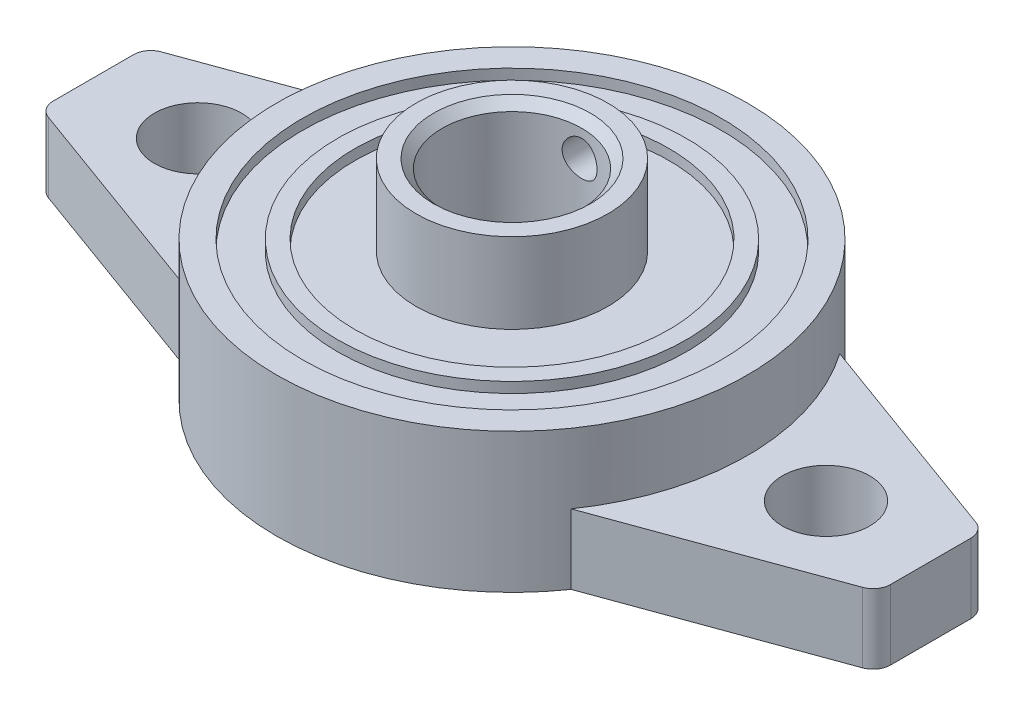
ISO-10303-21;
HEADER;
FILE_DESCRIPTION(('STEP AP214'),'2;1');
FILE_NAME('part.step','',(''),(''),'','','');
FILE_SCHEMA(('AUTOMOTIVE_DESIGN { 1 0 10303 214 1 1 1 1 }'));
ENDSEC;
DATA;
#1=APPLICATION_CONTEXT('core data for automotive mechanical design processes');
#2=APPLICATION_PROTOCOL_DEFINITION('international standard','automotive_design',2000,#1);
#3=PRODUCT_CONTEXT('',#1,'mechanical');
#4=PRODUCT('Part','Part','',(#3));
#5=PRODUCT_RELATED_PRODUCT_CATEGORY('part','',(#4));
#6=PRODUCT_DEFINITION_FORMATION('','',#4);
#7=PRODUCT_DEFINITION_CONTEXT('part definition',#1,'design');
#8=PRODUCT_DEFINITION('design','',#6,#7);
#9=PRODUCT_DEFINITION_SHAPE('','',#8);
#10=(LENGTH_UNIT() NAMED_UNIT(*) SI_UNIT(.MILLI.,.METRE.));
#11=(NAMED_UNIT(*) PLANE_ANGLE_UNIT() SI_UNIT($,.RADIAN.));
#12=(NAMED_UNIT(*) SI_UNIT($,.STERADIAN.) SOLID_ANGLE_UNIT());
#13=UNCERTAINTY_MEASURE_WITH_UNIT(LENGTH_MEASURE(1.E-05),#10,'distance_accuracy_value','');
#14=(GEOMETRIC_REPRESENTATION_CONTEXT(3) GLOBAL_UNCERTAINTY_ASSIGNED_CONTEXT((#13)) GLOBAL_UNIT_ASSIGNED_CONTEXT((#10,
#11,#12)) REPRESENTATION_CONTEXT('',''));
#15=CARTESIAN_POINT('',(0.,0.,0.));
#16=DIRECTION('',(0.,0.,1.));
#17=DIRECTION('',(1.,0.,0.));
#18=AXIS2_PLACEMENT_3D('',#15,#16,#17);
#19=CARTESIAN_POINT('',(0.,-2.50000000007189E-05,0.));
#20=DIRECTION('',(0.,1.,0.));
#21=DIRECTION('',(0.,0.,1.));
#22=AXIS2_PLACEMENT_3D('',#19,#20,#21);
#23=CYLINDRICAL_SURFACE('',#22,4.);
#24=CARTESIAN_POINT('',(0.,1.5,0.));
#25=DIRECTION('',(0.,-1.,0.));
#26=DIRECTION('',(0.,0.,-1.));
#27=AXIS2_PLACEMENT_3D('',#24,#25,#26);
#28=CIRCLE('',#27,4.);
#29=CARTESIAN_POINT('',(0.,1.5,-4.));
#30=VERTEX_POINT('',#29);
#31=EDGE_CURVE('E49',#30,#30,#28,.T.);
#32=ORIENTED_EDGE('',*,*,#31,.T.);
#33=EDGE_LOOP('',(#32));
#34=FACE_BOUND('',#33,.T.);
#35=CARTESIAN_POINT('',(0.,11.5,0.));
#36=DIRECTION('',(0.,1.,0.));
#37=DIRECTION('',(0.,0.,1.));
#38=AXIS2_PLACEMENT_3D('',#35,#36,#37);
#39=CIRCLE('',#38,4.);
#40=CARTESIAN_POINT('',(0.,11.5,4.));
#41=VERTEX_POINT('',#40);
#42=EDGE_CURVE('E307',#41,#41,#39,.T.);
#43=ORIENTED_EDGE('',*,*,#42,.T.);
#44=EDGE_LOOP('',(#43));
#45=FACE_BOUND('',#44,.T.);
#46=CARTESIAN_POINT('',(1.,10.,-3.87298334620742));
#47=CARTESIAN_POINT('',(0.9999984314387,9.94477969964321,-3.87298440057185));
#48=CARTESIAN_POINT('',(0.99541049820807,9.88954204056864,-3.87417722499278));
#49=CARTESIAN_POINT('',(0.977209250194446,9.78065296876739,-3.87880744892249));
#50=CARTESIAN_POINT('',(0.963590682698077,9.72700249822003,-3.8822461547418));
#51=CARTESIAN_POINT('',(0.927796479849635,9.62287858471216,-3.89095489813012));
#52=CARTESIAN_POINT('',(0.905631891140944,9.57240113784224,-3.8962225706936));
#53=CARTESIAN_POINT('',(0.853408456505407,9.47587565898752,-3.90799276818327));
#54=CARTESIAN_POINT('',(0.823349275424505,9.42982781516885,-3.91449534553241));
#55=CARTESIAN_POINT('',(0.755483370924517,9.34245534189415,-3.92816286540368));
#56=CARTESIAN_POINT('',(0.717534755081557,9.30124255985972,-3.93533839048709));
#57=CARTESIAN_POINT('',(0.635272825640328,9.22569544225612,-3.94945150206622));
#58=CARTESIAN_POINT('',(0.590958917672139,9.19136174975137,-3.95638906626691));
#59=CARTESIAN_POINT('',(0.496458080431564,9.13008981294742,-3.96936166208095));
#60=CARTESIAN_POINT('',(0.446197830478043,9.10326144473539,-3.975382749602));
#61=CARTESIAN_POINT('',(0.341705273717109,9.05847614233878,-3.9857232477043));
#62=CARTESIAN_POINT('',(0.287473554316777,9.0405178992338,-3.99004290933747));
#63=CARTESIAN_POINT('',(0.177743503501663,9.01434086616856,-3.99641903539262));
#64=CARTESIAN_POINT('',(0.122293087819589,9.00593214226937,-3.99851957537723));
#65=CARTESIAN_POINT('',(0.0107315277051075,8.99849664828978,-4.00037437642922));
#66=CARTESIAN_POINT('',(-0.0453795178152279,8.99946849111616,-4.00012898438682));
#67=CARTESIAN_POINT('',(-0.155352247172388,9.01062994010006,-3.99735237981413));
#68=CARTESIAN_POINT('',(-0.209236215601068,9.02061453002154,-3.99487200936349));
#69=CARTESIAN_POINT('',(-0.314538247413687,9.0491885080194,-3.98796334609942));
#70=CARTESIAN_POINT('',(-0.365956179370439,9.06777835415096,-3.98353494959376));
#71=CARTESIAN_POINT('',(-0.465406703501807,9.11320102827483,-3.97315003880358));
#72=CARTESIAN_POINT('',(-0.513404509766505,9.1401068178647,-3.96718007878021));
#73=CARTESIAN_POINT('',(-0.604275622340489,9.2013422716465,-3.9543596152386));
#74=CARTESIAN_POINT('',(-0.647148035085506,9.23567322742425,-3.94750895860996));
#75=CARTESIAN_POINT('',(-0.727774035084957,9.31188349679295,-3.93345485507808));
#76=CARTESIAN_POINT('',(-0.7653576790752,9.35394195693911,-3.92624687810367));
#77=CARTESIAN_POINT('',(-0.832976375963019,9.4438399894161,-3.91246017406683));
#78=CARTESIAN_POINT('',(-0.863011076046017,9.4916798317964,-3.90588147642388));
#79=CARTESIAN_POINT('',(-0.914788129022598,9.59211601365959,-3.89408198732659));
#80=CARTESIAN_POINT('',(-0.936489566970491,9.64473429212528,-3.88886793490288));
#81=CARTESIAN_POINT('',(-0.970685620636341,9.75303418723058,-3.88047456055983));
#82=CARTESIAN_POINT('',(-0.98318220655291,9.80871514559325,-3.87729480324087));
#83=CARTESIAN_POINT('',(-0.998331855466071,9.91998380060925,-3.87342142415656));
#84=CARTESIAN_POINT('',(-1.00123618956785,9.97553511733185,-3.87266435637459));
#85=CARTESIAN_POINT('',(-0.997806796206219,10.0863287746313,-3.87354937392416));
#86=CARTESIAN_POINT('',(-0.99147391913952,10.1415711431805,-3.87519123840506));
#87=CARTESIAN_POINT('',(-0.969970185575065,10.2492457059819,-3.88062832781824));
#88=CARTESIAN_POINT('',(-0.954945627312698,10.3017090906283,-3.8843878809375));
#89=CARTESIAN_POINT('',(-0.916647232668248,10.4033725831407,-3.89360287308385));
#90=CARTESIAN_POINT('',(-0.893372419085018,10.4525723036221,-3.89905851299445));
#91=CARTESIAN_POINT('',(-0.838708267174622,10.5473765111469,-3.91118454837305));
#92=CARTESIAN_POINT('',(-0.807168701534251,10.5928915360172,-3.91787667442657));
#93=CARTESIAN_POINT('',(-0.737060292934455,10.6780753451205,-3.93166833228686));
#94=CARTESIAN_POINT('',(-0.698490294805438,10.71774316666,-3.93876793091388));
#95=CARTESIAN_POINT('',(-0.614262720984724,10.7911244170284,-3.95278961212643));
#96=CARTESIAN_POINT('',(-0.568451952531591,10.8246640250195,-3.95970280824734));
#97=CARTESIAN_POINT('',(-0.471702682694674,10.8835743467805,-3.97238886645494));
#98=CARTESIAN_POINT('',(-0.42076444895759,10.9089454866433,-3.97816178801584));
#99=CARTESIAN_POINT('',(-0.315558201731089,10.9505784138112,-3.98788046295326));
#100=CARTESIAN_POINT('',(-0.26131738102788,10.9669057137516,-3.99183932008964));
#101=CARTESIAN_POINT('',(-0.150749760318806,10.9901841338434,-3.99754117358315));
#102=CARTESIAN_POINT('',(-0.0944233650412424,10.9971370634956,-3.99928459757363));
#103=CARTESIAN_POINT('',(0.0170835264433275,11.0013675895755,-4.00034169408811));
#104=CARTESIAN_POINT('',(0.0722538269660343,10.9989017090954,-3.99971978880008));
#105=CARTESIAN_POINT('',(0.181367496414741,10.9849521727057,-3.99625896457423));
#106=CARTESIAN_POINT('',(0.235310901780888,10.9734687849869,-3.99342011157094));
#107=CARTESIAN_POINT('',(0.340171035644817,10.9419477802291,-3.98585432853963));
#108=CARTESIAN_POINT('',(0.391102494581019,10.9219565466854,-3.98113764502668));
#109=CARTESIAN_POINT('',(0.488917053041468,10.8740294209807,-3.97031288913382));
#110=CARTESIAN_POINT('',(0.535799641265051,10.8460925273304,-3.96420464137727));
#111=CARTESIAN_POINT('',(0.625401928423901,10.7822847660029,-3.95107249681342));
#112=CARTESIAN_POINT('',(0.667994988300588,10.7462398570926,-3.94403016945647));
#113=CARTESIAN_POINT('',(0.746615020271252,10.6675771480262,-3.92990649053207));
#114=CARTESIAN_POINT('',(0.782640325068178,10.6249576839021,-3.92282512952424));
#115=CARTESIAN_POINT('',(0.84776202647924,10.5333985857987,-3.90927475860683));
#116=CARTESIAN_POINT('',(0.876716619446593,10.4843558765875,-3.90281963730391));
#117=CARTESIAN_POINT('',(0.925926896615622,10.3819445100772,-3.8914395555011));
#118=CARTESIAN_POINT('',(0.946188909759557,10.3285790338927,-3.88651348244814));
#119=CARTESIAN_POINT('',(0.974422528565572,10.2294229881737,-3.87951908741315));
#120=CARTESIAN_POINT('',(0.983993170595829,10.1841068356176,-3.87708663005761));
#121=CARTESIAN_POINT('',(0.99678229257282,10.0925311309985,-3.87381838580358));
#122=CARTESIAN_POINT('',(1.00000131437052,10.0462716597494,-3.87298246270639));
#123=CARTESIAN_POINT('',(1.,10.,-3.87298334620742));
#124=B_SPLINE_CURVE_WITH_KNOTS('',3,(#46,#47,#48,#49,#50,#51,#52,#53,#54,#55,#56,#57,#58,#59,
#60,#61,#62,#63,#64,#65,#66,#67,#68,#69,#70,#71,#72,#73,#74,#75,#76,#77,#78,#79,#80,#81,#82,#83,
#84,#85,#86,#87,#88,#89,#90,#91,#92,#93,#94,#95,#96,#97,#98,#99,#100,#101,#102,#103,#104,#105,
#106,#107,#108,#109,#110,#111,#112,#113,#114,#115,#116,#117,#118,#119,#120,#121,#122,#123),
.UNSPECIFIED.,.T.,.F.,(4,2,2,2,2,2,2,2,2,2,2,2,2,2,2,2,2,2,2,2,2,2,2,2,2,2,2,2,2,2,2,2,2,2,2,2,
2,2,4),(0.,0.16549097667523,0.331078296534212,0.496452290829153,0.661833306984659,
0.830495816734649,0.999174085882212,1.17020598555443,1.34121263935111,1.50875500394413,
1.67627259462683,1.84007305071853,2.00388222686189,2.16917149698052,2.3344895418384,
2.50428186625039,2.67408212476195,2.84470572799635,3.01529280048094,3.18137429900962,
3.34744050869795,3.51078961999957,3.67415808564842,3.84073138339938,4.00733207550293,
4.17810132382402,4.34886166284096,4.51836829119046,4.6878421955989,4.85273378447257,
5.01762046947067,5.18161950620159,5.34563922291504,5.51358838629103,5.68158012622478,
5.85270590910145,6.02370688542923,6.16239130867207,6.30106390036083),.UNSPECIFIED.);
#125=CARTESIAN_POINT('',(1.,10.,-3.87298334620742));
#126=VERTEX_POINT('',#125);
#127=EDGE_CURVE('E207',#126,#126,#124,.T.);
#128=ORIENTED_EDGE('',*,*,#127,.T.);
#129=EDGE_LOOP('',(#128));
#130=FACE_BOUND('',#129,.T.);
#131=ADVANCED_FACE('F40',(#34,#45,#130),#23,.F.);
#132=CARTESIAN_POINT('',(0.,8.,0.));
#133=DIRECTION('',(0.,1.,0.));
#134=DIRECTION('',(0.,0.,1.));
#135=AXIS2_PLACEMENT_3D('',#132,#133,#134);
#136=PLANE('',#135);
#137=CARTESIAN_POINT('',(0.,8.,0.));
#138=DIRECTION('',(0.,1.,0.));
#139=DIRECTION('',(0.,0.,1.));
#140=AXIS2_PLACEMENT_3D('',#137,#138,#139);
#141=CIRCLE('',#140,9.);
#142=CARTESIAN_POINT('',(0.,8.,9.));
#143=VERTEX_POINT('',#142);
#144=EDGE_CURVE('E396',#143,#143,#141,.T.);
#145=ORIENTED_EDGE('',*,*,#144,.F.);
#146=EDGE_LOOP('',(#145));
#147=FACE_BOUND('',#146,.T.);
#148=CARTESIAN_POINT('',(0.,8.,0.));
#149=DIRECTION('',(0.,1.,0.));
#150=DIRECTION('',(0.,0.,1.));
#151=AXIS2_PLACEMENT_3D('',#148,#149,#150);
#152=CIRCLE('',#151,10.);
#153=CARTESIAN_POINT('',(0.,8.,10.));
#154=VERTEX_POINT('',#153);
#155=EDGE_CURVE('E385',#154,#154,#152,.T.);
#156=ORIENTED_EDGE('',*,*,#155,.T.);
#157=EDGE_LOOP('',(#156));
#158=FACE_BOUND('',#157,.T.);
#159=ADVANCED_FACE('F236',(#147,#158),#136,.T.);
#160=CARTESIAN_POINT('',(0.,8.,0.));
#161=DIRECTION('',(0.,1.,0.));
#162=DIRECTION('',(0.,0.,1.));
#163=AXIS2_PLACEMENT_3D('',#160,#161,#162);
#164=CIRCLE('',#163,12.);
#165=CARTESIAN_POINT('',(0.,8.,12.));
#166=VERTEX_POINT('',#165);
#167=EDGE_CURVE('E268',#166,#166,#164,.T.);
#168=ORIENTED_EDGE('',*,*,#167,.F.);
#169=EDGE_LOOP('',(#168));
#170=FACE_BOUND('',#169,.T.);
#171=CARTESIAN_POINT('',(0.,8.,0.));
#172=DIRECTION('',(0.,1.,0.));
#173=DIRECTION('',(0.,0.,1.));
#174=AXIS2_PLACEMENT_3D('',#171,#172,#173);
#175=CIRCLE('',#174,13.5);
#176=CARTESIAN_POINT('',(0.,8.,13.5));
#177=VERTEX_POINT('',#176);
#178=EDGE_CURVE('E261',#177,#177,#175,.T.);
#179=ORIENTED_EDGE('',*,*,#178,.T.);
#180=EDGE_LOOP('',(#179));
#181=FACE_BOUND('',#180,.T.);
#182=ADVANCED_FACE('F371',(#170,#181),#136,.T.);
#183=CARTESIAN_POINT('',(23.,4.,2.29979246179029));
#184=DIRECTION('',(0.,1.,0.));
#185=DIRECTION('',(0.,0.,1.));
#186=AXIS2_PLACEMENT_3D('',#183,#184,#185);
#187=PLANE('',#186);
#188=CARTESIAN_POINT('',(0.,4.,0.));
#189=DIRECTION('',(0.,1.,0.));
#190=DIRECTION('',(0.,0.,1.));
#191=AXIS2_PLACEMENT_3D('',#188,#189,#190);
#192=CIRCLE('',#191,13.5);
#193=CARTESIAN_POINT('',(11.0893677538251,4.,7.69908584316501));
#194=VERTEX_POINT('',#193);
#195=CARTESIAN_POINT('',(11.0893677538251,4.,-7.69908584316501));
#196=VERTEX_POINT('',#195);
#197=EDGE_CURVE('E257',#194,#196,#192,.T.);
#198=ORIENTED_EDGE('',*,*,#197,.F.);
#199=DIRECTION('',(0.93969262078591,0.,-0.342020143325665));
#200=VECTOR('',#199,1.);
#201=CARTESIAN_POINT('',(23.3420201433257,4.,3.2394850825762));
#202=LINE('',#201,#200);
#203=CARTESIAN_POINT('',(23.3420201433257,4.,3.2394850825762));
#204=VERTEX_POINT('',#203);
#205=EDGE_CURVE('E57',#194,#204,#202,.T.);
#206=ORIENTED_EDGE('',*,*,#205,.T.);
#207=CARTESIAN_POINT('',(23.,4.,2.29979246179029));
#208=DIRECTION('',(0.,1.,0.));
#209=DIRECTION('',(0.,0.,1.));
#210=AXIS2_PLACEMENT_3D('',#207,#208,#209);
#211=CIRCLE('',#210,1.);
#212=CARTESIAN_POINT('',(24.,4.,2.29979246179028));
#213=VERTEX_POINT('',#212);
#214=EDGE_CURVE('E638',#204,#213,#211,.T.);
#215=ORIENTED_EDGE('',*,*,#214,.T.);
#216=DIRECTION('',(0.,0.,-1.));
#217=VECTOR('',#216,1.);
#218=CARTESIAN_POINT('',(24.,4.,2.29979246179028));
#219=LINE('',#218,#217);
#220=CARTESIAN_POINT('',(24.,4.,-2.29979246179028));
#221=VERTEX_POINT('',#220);
#222=EDGE_CURVE('E115',#213,#221,#219,.T.);
#223=ORIENTED_EDGE('',*,*,#222,.T.);
#224=CARTESIAN_POINT('',(23.,4.,-2.29979246179029));
#225=DIRECTION('',(0.,1.,0.));
#226=DIRECTION('',(0.,0.,1.));
#227=AXIS2_PLACEMENT_3D('',#224,#225,#226);
#228=CIRCLE('',#227,1.);
#229=CARTESIAN_POINT('',(23.3420201433257,4.,-3.2394850825762));
#230=VERTEX_POINT('',#229);
#231=EDGE_CURVE('E192',#221,#230,#228,.T.);
#232=ORIENTED_EDGE('',*,*,#231,.T.);
#233=DIRECTION('',(-0.93969262078591,0.,-0.342020143325665));
#234=VECTOR('',#233,1.);
#235=CARTESIAN_POINT('',(23.3420201433257,4.,-3.2394850825762));
#236=LINE('',#235,#234);
#237=EDGE_CURVE('E188',#230,#196,#236,.T.);
#238=ORIENTED_EDGE('',*,*,#237,.T.);
#239=EDGE_LOOP('',(#198,#206,#215,#223,#232,#238));
#240=FACE_BOUND('',#239,.T.);
#241=CARTESIAN_POINT('',(18.,4.,0.));
#242=DIRECTION('',(0.,1.,0.));
#243=DIRECTION('',(0.,0.,1.));
#244=AXIS2_PLACEMENT_3D('',#241,#242,#243);
#245=CIRCLE('',#244,2.5);
#246=CARTESIAN_POINT('',(18.,4.,2.5));
#247=VERTEX_POINT('',#246);
#248=EDGE_CURVE('E273',#247,#247,#245,.T.);
#249=ORIENTED_EDGE('',*,*,#248,.F.);
#250=EDGE_LOOP('',(#249));
#251=FACE_BOUND('',#250,.T.);
#252=ADVANCED_FACE('F365',(#240,#251),#187,.T.);
#253=CARTESIAN_POINT('',(-11.0893677538251,4.,-7.69908584316501));
#254=VERTEX_POINT('',#253);
#255=CARTESIAN_POINT('',(-11.0893677538251,4.,7.69908584316501));
#256=VERTEX_POINT('',#255);
#257=EDGE_CURVE('E169',#254,#256,#192,.T.);
#258=ORIENTED_EDGE('',*,*,#257,.F.);
#259=DIRECTION('',(-0.93969262078591,0.,0.342020143325665));
#260=VECTOR('',#259,1.);
#261=CARTESIAN_POINT('',(-23.3420201433257,4.,-3.2394850825762));
#262=LINE('',#261,#260);
#263=CARTESIAN_POINT('',(-23.3420201433257,4.,-3.2394850825762));
#264=VERTEX_POINT('',#263);
#265=EDGE_CURVE('E185',#254,#264,#262,.T.);
#266=ORIENTED_EDGE('',*,*,#265,.T.);
#267=CARTESIAN_POINT('',(-23.,4.,-2.29979246179029));
#268=DIRECTION('',(0.,1.,0.));
#269=DIRECTION('',(0.,0.,1.));
#270=AXIS2_PLACEMENT_3D('',#267,#268,#269);
#271=CIRCLE('',#270,1.);
#272=CARTESIAN_POINT('',(-24.,4.,-2.29979246179028));
#273=VERTEX_POINT('',#272);
#274=EDGE_CURVE('E187',#264,#273,#271,.T.);
#275=ORIENTED_EDGE('',*,*,#274,.T.);
#276=DIRECTION('',(0.,0.,1.));
#277=VECTOR('',#276,1.);
#278=CARTESIAN_POINT('',(-24.,4.,2.29979246179028));
#279=LINE('',#278,#277);
#280=CARTESIAN_POINT('',(-24.,4.,2.29979246179028));
#281=VERTEX_POINT('',#280);
#282=EDGE_CURVE('E147',#273,#281,#279,.T.);
#283=ORIENTED_EDGE('',*,*,#282,.T.);
#284=CARTESIAN_POINT('',(-23.,4.,2.29979246179029));
#285=DIRECTION('',(0.,1.,0.));
#286=DIRECTION('',(0.,0.,1.));
#287=AXIS2_PLACEMENT_3D('',#284,#285,#286);
#288=CIRCLE('',#287,1.);
#289=CARTESIAN_POINT('',(-23.3420201433257,4.,3.2394850825762));
#290=VERTEX_POINT('',#289);
#291=EDGE_CURVE('E139',#281,#290,#288,.T.);
#292=ORIENTED_EDGE('',*,*,#291,.T.);
#293=DIRECTION('',(0.93969262078591,0.,0.342020143325665));
#294=VECTOR('',#293,1.);
#295=CARTESIAN_POINT('',(-23.3420201433257,4.,3.2394850825762));
#296=LINE('',#295,#294);
#297=EDGE_CURVE('E144',#290,#256,#296,.T.);
#298=ORIENTED_EDGE('',*,*,#297,.T.);
#299=EDGE_LOOP('',(#258,#266,#275,#283,#292,#298));
#300=FACE_BOUND('',#299,.T.);
#301=CARTESIAN_POINT('',(-18.,4.,0.));
#302=DIRECTION('',(0.,1.,0.));
#303=DIRECTION('',(0.,0.,1.));
#304=AXIS2_PLACEMENT_3D('',#301,#302,#303);
#305=CIRCLE('',#304,2.5);
#306=CARTESIAN_POINT('',(-18.,4.,2.5));
#307=VERTEX_POINT('',#306);
#308=EDGE_CURVE('E634',#307,#307,#305,.T.);
#309=ORIENTED_EDGE('',*,*,#308,.F.);
#310=EDGE_LOOP('',(#309));
#311=FACE_BOUND('',#310,.T.);
#312=ADVANCED_FACE('F141',(#300,#311),#187,.T.);
#313=CARTESIAN_POINT('',(23.,0.,2.29979246179029));
#314=DIRECTION('',(0.,1.,0.));
#315=DIRECTION('',(0.,0.,1.));
#316=AXIS2_PLACEMENT_3D('',#313,#314,#315);
#317=PLANE('',#316);
#318=CARTESIAN_POINT('',(0.,0.,0.));
#319=DIRECTION('',(0.,-1.,0.));
#320=DIRECTION('',(0.,0.,-1.));
#321=AXIS2_PLACEMENT_3D('',#318,#319,#320);
#322=CIRCLE('',#321,12.5);
#323=CARTESIAN_POINT('',(0.,0.,-12.5));
#324=VERTEX_POINT('',#323);
#325=EDGE_CURVE('E230',#324,#324,#322,.T.);
#326=ORIENTED_EDGE('',*,*,#325,.F.);
#327=EDGE_LOOP('',(#326));
#328=FACE_BOUND('',#327,.T.);
#329=CARTESIAN_POINT('',(-18.,0.,0.));
#330=DIRECTION('',(0.,1.,0.));
#331=DIRECTION('',(0.,0.,1.));
#332=AXIS2_PLACEMENT_3D('',#329,#330,#331);
#333=CIRCLE('',#332,2.5);
#334=CARTESIAN_POINT('',(-18.,0.,2.5));
#335=VERTEX_POINT('',#334);
#336=EDGE_CURVE('E626',#335,#335,#333,.T.);
#337=ORIENTED_EDGE('',*,*,#336,.T.);
#338=EDGE_LOOP('',(#337));
#339=FACE_BOUND('',#338,.T.);
#340=CARTESIAN_POINT('',(23.,0.,2.29979246179029));
#341=DIRECTION('',(0.,1.,0.));
#342=DIRECTION('',(0.,0.,1.));
#343=AXIS2_PLACEMENT_3D('',#340,#341,#342);
#344=CIRCLE('',#343,1.);
#345=CARTESIAN_POINT('',(23.3420201433257,0.,3.2394850825762));
#346=VERTEX_POINT('',#345);
#347=CARTESIAN_POINT('',(24.,0.,2.29979246179028));
#348=VERTEX_POINT('',#347);
#349=EDGE_CURVE('E628',#346,#348,#344,.T.);
#350=ORIENTED_EDGE('',*,*,#349,.F.);
#351=DIRECTION('',(0.93969262078591,0.,-0.342020143325665));
#352=VECTOR('',#351,1.);
#353=CARTESIAN_POINT('',(23.3420201433257,0.,3.2394850825762));
#354=LINE('',#353,#352);
#355=CARTESIAN_POINT('',(11.0893677538251,0.,7.69908584316501));
#356=VERTEX_POINT('',#355);
#357=EDGE_CURVE('E106',#356,#346,#354,.T.);
#358=ORIENTED_EDGE('',*,*,#357,.F.);
#359=CARTESIAN_POINT('',(0.,0.,0.));
#360=DIRECTION('',(0.,1.,0.));
#361=DIRECTION('',(0.,0.,1.));
#362=AXIS2_PLACEMENT_3D('',#359,#360,#361);
#363=CIRCLE('',#362,13.5);
#364=CARTESIAN_POINT('',(-11.0893677538251,0.,7.69908584316501));
#365=VERTEX_POINT('',#364);
#366=EDGE_CURVE('E100',#365,#356,#363,.T.);
#367=ORIENTED_EDGE('',*,*,#366,.F.);
#368=DIRECTION('',(0.93969262078591,0.,0.342020143325665));
#369=VECTOR('',#368,1.);
#370=CARTESIAN_POINT('',(-23.3420201433257,0.,3.2394850825762));
#371=LINE('',#370,#369);
#372=CARTESIAN_POINT('',(-23.3420201433257,0.,3.2394850825762));
#373=VERTEX_POINT('',#372);
#374=EDGE_CURVE('E660',#373,#365,#371,.T.);
#375=ORIENTED_EDGE('',*,*,#374,.F.);
#376=CARTESIAN_POINT('',(-23.,0.,2.29979246179029));
#377=DIRECTION('',(0.,1.,0.));
#378=DIRECTION('',(0.,0.,1.));
#379=AXIS2_PLACEMENT_3D('',#376,#377,#378);
#380=CIRCLE('',#379,1.);
#381=CARTESIAN_POINT('',(-24.,0.,2.29979246179028));
#382=VERTEX_POINT('',#381);
#383=EDGE_CURVE('E156',#382,#373,#380,.T.);
#384=ORIENTED_EDGE('',*,*,#383,.F.);
#385=DIRECTION('',(0.,0.,1.));
#386=VECTOR('',#385,1.);
#387=CARTESIAN_POINT('',(-24.,0.,2.29979246179028));
#388=LINE('',#387,#386);
#389=CARTESIAN_POINT('',(-24.,0.,-2.29979246179028));
#390=VERTEX_POINT('',#389);
#391=EDGE_CURVE('E657',#390,#382,#388,.T.);
#392=ORIENTED_EDGE('',*,*,#391,.F.);
#393=CARTESIAN_POINT('',(-23.,0.,-2.29979246179029));
#394=DIRECTION('',(0.,1.,0.));
#395=DIRECTION('',(0.,0.,1.));
#396=AXIS2_PLACEMENT_3D('',#393,#394,#395);
#397=CIRCLE('',#396,1.);
#398=CARTESIAN_POINT('',(-23.3420201433257,0.,-3.2394850825762));
#399=VERTEX_POINT('',#398);
#400=EDGE_CURVE('E655',#399,#390,#397,.T.);
#401=ORIENTED_EDGE('',*,*,#400,.F.);
#402=DIRECTION('',(-0.93969262078591,0.,0.342020143325665));
#403=VECTOR('',#402,1.);
#404=CARTESIAN_POINT('',(-23.3420201433257,0.,-3.2394850825762));
#405=LINE('',#404,#403);
#406=CARTESIAN_POINT('',(-11.0893677538251,0.,-7.69908584316501));
#407=VERTEX_POINT('',#406);
#408=EDGE_CURVE('E653',#407,#399,#405,.T.);
#409=ORIENTED_EDGE('',*,*,#408,.F.);
#410=CARTESIAN_POINT('',(0.,0.,0.));
#411=DIRECTION('',(0.,1.,0.));
#412=DIRECTION('',(0.,0.,1.));
#413=AXIS2_PLACEMENT_3D('',#410,#411,#412);
#414=CIRCLE('',#413,13.5);
#415=CARTESIAN_POINT('',(11.0893677538251,0.,-7.69908584316501));
#416=VERTEX_POINT('',#415);
#417=EDGE_CURVE('E651',#416,#407,#414,.T.);
#418=ORIENTED_EDGE('',*,*,#417,.F.);
#419=DIRECTION('',(-0.93969262078591,0.,-0.342020143325665));
#420=VECTOR('',#419,1.);
#421=CARTESIAN_POINT('',(23.3420201433257,0.,-3.2394850825762));
#422=LINE('',#421,#420);
#423=CARTESIAN_POINT('',(23.3420201433257,0.,-3.2394850825762));
#424=VERTEX_POINT('',#423);
#425=EDGE_CURVE('E649',#424,#416,#422,.T.);
#426=ORIENTED_EDGE('',*,*,#425,.F.);
#427=CARTESIAN_POINT('',(23.,0.,-2.29979246179029));
#428=DIRECTION('',(0.,1.,0.));
#429=DIRECTION('',(0.,0.,1.));
#430=AXIS2_PLACEMENT_3D('',#427,#428,#429);
#431=CIRCLE('',#430,1.);
#432=CARTESIAN_POINT('',(24.,0.,-2.29979246179028));
#433=VERTEX_POINT('',#432);
#434=EDGE_CURVE('E647',#433,#424,#431,.T.);
#435=ORIENTED_EDGE('',*,*,#434,.F.);
#436=DIRECTION('',(0.,0.,-1.));
#437=VECTOR('',#436,1.);
#438=CARTESIAN_POINT('',(24.,0.,2.29979246179028));
#439=LINE('',#438,#437);
#440=EDGE_CURVE('E645',#348,#433,#439,.T.);
#441=ORIENTED_EDGE('',*,*,#440,.F.);
#442=EDGE_LOOP('',(#350,#358,#367,#375,#384,#392,#401,#409,#418,#426,#435,#441));
#443=FACE_BOUND('',#442,.T.);
#444=CARTESIAN_POINT('',(18.,0.,0.));
#445=DIRECTION('',(0.,1.,0.));
#446=DIRECTION('',(0.,0.,1.));
#447=AXIS2_PLACEMENT_3D('',#444,#445,#446);
#448=CIRCLE('',#447,2.5);
#449=CARTESIAN_POINT('',(18.,0.,2.5));
#450=VERTEX_POINT('',#449);
#451=EDGE_CURVE('E271',#450,#450,#448,.T.);
#452=ORIENTED_EDGE('',*,*,#451,.T.);
#453=EDGE_LOOP('',(#452));
#454=FACE_BOUND('',#453,.T.);
#455=ADVANCED_FACE('F327',(#328,#339,#443,#454),#317,.F.);
#456=CARTESIAN_POINT('',(23.,4.,2.29979246179029));
#457=DIRECTION('',(0.,-1.,0.));
#458=DIRECTION('',(0.,0.,-1.));
#459=AXIS2_PLACEMENT_3D('',#456,#457,#458);
#460=CYLINDRICAL_SURFACE('',#459,1.);
#461=ORIENTED_EDGE('',*,*,#349,.T.);
#462=DIRECTION('',(0.,-1.,0.));
#463=VECTOR('',#462,1.);
#464=CARTESIAN_POINT('',(24.,4.,2.29979246179028));
#465=LINE('',#464,#463);
#466=EDGE_CURVE('E277',#213,#348,#465,.T.);
#467=ORIENTED_EDGE('',*,*,#466,.F.);
#468=ORIENTED_EDGE('',*,*,#214,.F.);
#469=DIRECTION('',(0.,-1.,0.));
#470=VECTOR('',#469,1.);
#471=CARTESIAN_POINT('',(23.3420201433257,4.,3.2394850825762));
#472=LINE('',#471,#470);
#473=EDGE_CURVE('E165',#204,#346,#472,.T.);
#474=ORIENTED_EDGE('',*,*,#473,.T.);
#475=EDGE_LOOP('',(#461,#467,#468,#474));
#476=FACE_BOUND('',#475,.T.);
#477=ADVANCED_FACE('F323',(#476),#460,.T.);
#478=CARTESIAN_POINT('',(24.,4.,2.29979246179028));
#479=DIRECTION('',(-1.,0.,0.));
#480=DIRECTION('',(0.,0.,1.));
#481=AXIS2_PLACEMENT_3D('',#478,#479,#480);
#482=PLANE('',#481);
#483=ORIENTED_EDGE('',*,*,#440,.T.);
#484=DIRECTION('',(0.,-1.,0.));
#485=VECTOR('',#484,1.);
#486=CARTESIAN_POINT('',(24.,4.,-2.29979246179028));
#487=LINE('',#486,#485);
#488=EDGE_CURVE('E299',#221,#433,#487,.T.);
#489=ORIENTED_EDGE('',*,*,#488,.F.);
#490=ORIENTED_EDGE('',*,*,#222,.F.);
#491=ORIENTED_EDGE('',*,*,#466,.T.);
#492=EDGE_LOOP('',(#483,#489,#490,#491));
#493=FACE_BOUND('',#492,.T.);
#494=ADVANCED_FACE('F326',(#493),#482,.F.);
#495=CARTESIAN_POINT('',(23.,4.,-2.29979246179029));
#496=DIRECTION('',(0.,-1.,0.));
#497=DIRECTION('',(0.,0.,-1.));
#498=AXIS2_PLACEMENT_3D('',#495,#496,#497);
#499=CYLINDRICAL_SURFACE('',#498,1.);
#500=ORIENTED_EDGE('',*,*,#434,.T.);
#501=DIRECTION('',(0.,-1.,0.));
#502=VECTOR('',#501,1.);
#503=CARTESIAN_POINT('',(23.3420201433257,4.,-3.2394850825762));
#504=LINE('',#503,#502);
#505=EDGE_CURVE('E197',#230,#424,#504,.T.);
#506=ORIENTED_EDGE('',*,*,#505,.F.);
#507=ORIENTED_EDGE('',*,*,#231,.F.);
#508=ORIENTED_EDGE('',*,*,#488,.T.);
#509=EDGE_LOOP('',(#500,#506,#507,#508));
#510=FACE_BOUND('',#509,.T.);
#511=ADVANCED_FACE('F330',(#510),#499,.T.);
#512=CARTESIAN_POINT('',(23.3420201433257,4.,-3.2394850825762));
#513=DIRECTION('',(-0.342020143325665,0.,0.93969262078591));
#514=DIRECTION('',(0.93969262078591,0.,0.342020143325665));
#515=AXIS2_PLACEMENT_3D('',#512,#513,#514);
#516=PLANE('',#515);
#517=ORIENTED_EDGE('',*,*,#425,.T.);
#518=DIRECTION('',(0.,-1.,0.));
#519=VECTOR('',#518,1.);
#520=CARTESIAN_POINT('',(11.0893677538251,4.,-7.69908584316501));
#521=LINE('',#520,#519);
#522=EDGE_CURVE('E181',#196,#416,#521,.T.);
#523=ORIENTED_EDGE('',*,*,#522,.F.);
#524=ORIENTED_EDGE('',*,*,#237,.F.);
#525=ORIENTED_EDGE('',*,*,#505,.T.);
#526=EDGE_LOOP('',(#517,#523,#524,#525));
#527=FACE_BOUND('',#526,.T.);
#528=ADVANCED_FACE('F333',(#527),#516,.F.);
#529=CARTESIAN_POINT('',(-23.3420201433257,4.,-3.2394850825762));
#530=DIRECTION('',(0.342020143325665,0.,0.93969262078591));
#531=DIRECTION('',(0.93969262078591,0.,-0.342020143325665));
#532=AXIS2_PLACEMENT_3D('',#529,#530,#531);
#533=PLANE('',#532);
#534=ORIENTED_EDGE('',*,*,#408,.T.);
#535=DIRECTION('',(0.,-1.,0.));
#536=VECTOR('',#535,1.);
#537=CARTESIAN_POINT('',(-23.3420201433257,4.,-3.2394850825762));
#538=LINE('',#537,#536);
#539=EDGE_CURVE('E182',#264,#399,#538,.T.);
#540=ORIENTED_EDGE('',*,*,#539,.F.);
#541=ORIENTED_EDGE('',*,*,#265,.F.);
#542=DIRECTION('',(0.,-1.,0.));
#543=VECTOR('',#542,1.);
#544=CARTESIAN_POINT('',(-11.0893677538251,4.,-7.69908584316501));
#545=LINE('',#544,#543);
#546=EDGE_CURVE('E178',#254,#407,#545,.T.);
#547=ORIENTED_EDGE('',*,*,#546,.T.);
#548=EDGE_LOOP('',(#534,#540,#541,#547));
#549=FACE_BOUND('',#548,.T.);
#550=ADVANCED_FACE('F336',(#549),#533,.F.);
#551=CARTESIAN_POINT('',(-23.,4.,-2.29979246179029));
#552=DIRECTION('',(0.,-1.,0.));
#553=DIRECTION('',(0.,0.,-1.));
#554=AXIS2_PLACEMENT_3D('',#551,#552,#553);
#555=CYLINDRICAL_SURFACE('',#554,1.);
#556=ORIENTED_EDGE('',*,*,#400,.T.);
#557=DIRECTION('',(0.,-1.,0.));
#558=VECTOR('',#557,1.);
#559=CARTESIAN_POINT('',(-24.,4.,-2.29979246179028));
#560=LINE('',#559,#558);
#561=EDGE_CURVE('E293',#273,#390,#560,.T.);
#562=ORIENTED_EDGE('',*,*,#561,.F.);
#563=ORIENTED_EDGE('',*,*,#274,.F.);
#564=ORIENTED_EDGE('',*,*,#539,.T.);
#565=EDGE_LOOP('',(#556,#562,#563,#564));
#566=FACE_BOUND('',#565,.T.);
#567=ADVANCED_FACE('F340',(#566),#555,.T.);
#568=CARTESIAN_POINT('',(-24.,4.,2.29979246179028));
#569=DIRECTION('',(1.,0.,0.));
#570=DIRECTION('',(0.,0.,-1.));
#571=AXIS2_PLACEMENT_3D('',#568,#569,#570);
#572=PLANE('',#571);
#573=ORIENTED_EDGE('',*,*,#391,.T.);
#574=DIRECTION('',(0.,-1.,0.));
#575=VECTOR('',#574,1.);
#576=CARTESIAN_POINT('',(-24.,4.,2.29979246179028));
#577=LINE('',#576,#575);
#578=EDGE_CURVE('E159',#281,#382,#577,.T.);
#579=ORIENTED_EDGE('',*,*,#578,.F.);
#580=ORIENTED_EDGE('',*,*,#282,.F.);
#581=ORIENTED_EDGE('',*,*,#561,.T.);
#582=EDGE_LOOP('',(#573,#579,#580,#581));
#583=FACE_BOUND('',#582,.T.);
#584=ADVANCED_FACE('F344',(#583),#572,.F.);
#585=CARTESIAN_POINT('',(-23.,4.,2.29979246179029));
#586=DIRECTION('',(0.,-1.,0.));
#587=DIRECTION('',(0.,0.,-1.));
#588=AXIS2_PLACEMENT_3D('',#585,#586,#587);
#589=CYLINDRICAL_SURFACE('',#588,1.);
#590=ORIENTED_EDGE('',*,*,#383,.T.);
#591=DIRECTION('',(0.,-1.,0.));
#592=VECTOR('',#591,1.);
#593=CARTESIAN_POINT('',(-23.3420201433257,4.,3.2394850825762));
#594=LINE('',#593,#592);
#595=EDGE_CURVE('E153',#290,#373,#594,.T.);
#596=ORIENTED_EDGE('',*,*,#595,.F.);
#597=ORIENTED_EDGE('',*,*,#291,.F.);
#598=ORIENTED_EDGE('',*,*,#578,.T.);
#599=EDGE_LOOP('',(#590,#596,#597,#598));
#600=FACE_BOUND('',#599,.T.);
#601=ADVANCED_FACE('F154',(#600),#589,.T.);
#602=CARTESIAN_POINT('',(-23.3420201433257,4.,3.2394850825762));
#603=DIRECTION('',(0.342020143325665,0.,-0.93969262078591));
#604=DIRECTION('',(-0.93969262078591,0.,-0.342020143325665));
#605=AXIS2_PLACEMENT_3D('',#602,#603,#604);
#606=PLANE('',#605);
#607=ORIENTED_EDGE('',*,*,#374,.T.);
#608=DIRECTION('',(0.,-1.,0.));
#609=VECTOR('',#608,1.);
#610=CARTESIAN_POINT('',(-11.0893677538251,4.,7.69908584316501));
#611=LINE('',#610,#609);
#612=EDGE_CURVE('E160',#256,#365,#611,.T.);
#613=ORIENTED_EDGE('',*,*,#612,.F.);
#614=ORIENTED_EDGE('',*,*,#297,.F.);
#615=ORIENTED_EDGE('',*,*,#595,.T.);
#616=EDGE_LOOP('',(#607,#613,#614,#615));
#617=FACE_BOUND('',#616,.T.);
#618=ADVANCED_FACE('F162',(#617),#606,.F.);
#619=CARTESIAN_POINT('',(0.,4.,0.));
#620=DIRECTION('',(0.,-1.,0.));
#621=DIRECTION('',(0.,0.,-1.));
#622=AXIS2_PLACEMENT_3D('',#619,#620,#621);
#623=CYLINDRICAL_SURFACE('',#622,13.5);
#624=ORIENTED_EDGE('',*,*,#366,.T.);
#625=DIRECTION('',(0.,-1.,0.));
#626=VECTOR('',#625,1.);
#627=CARTESIAN_POINT('',(11.0893677538251,4.,7.69908584316501));
#628=LINE('',#627,#626);
#629=EDGE_CURVE('E175',#194,#356,#628,.T.);
#630=ORIENTED_EDGE('',*,*,#629,.F.);
#631=ORIENTED_EDGE('',*,*,#197,.T.);
#632=ORIENTED_EDGE('',*,*,#522,.T.);
#633=ORIENTED_EDGE('',*,*,#417,.T.);
#634=ORIENTED_EDGE('',*,*,#546,.F.);
#635=ORIENTED_EDGE('',*,*,#257,.T.);
#636=ORIENTED_EDGE('',*,*,#612,.T.);
#637=EDGE_LOOP('',(#624,#630,#631,#632,#633,#634,#635,#636));
#638=FACE_BOUND('',#637,.T.);
#639=ORIENTED_EDGE('',*,*,#178,.F.);
#640=EDGE_LOOP('',(#639));
#641=FACE_BOUND('',#640,.T.);
#642=ADVANCED_FACE('F353',(#638,#641),#623,.T.);
#643=CARTESIAN_POINT('',(23.3420201433257,4.,3.2394850825762));
#644=DIRECTION('',(-0.342020143325665,0.,-0.93969262078591));
#645=DIRECTION('',(-0.93969262078591,0.,0.342020143325665));
#646=AXIS2_PLACEMENT_3D('',#643,#644,#645);
#647=PLANE('',#646);
#648=ORIENTED_EDGE('',*,*,#357,.T.);
#649=ORIENTED_EDGE('',*,*,#473,.F.);
#650=ORIENTED_EDGE('',*,*,#205,.F.);
#651=ORIENTED_EDGE('',*,*,#629,.T.);
#652=EDGE_LOOP('',(#648,#649,#650,#651));
#653=FACE_BOUND('',#652,.T.);
#654=ADVANCED_FACE('F356',(#653),#647,.F.);
#655=CARTESIAN_POINT('',(-18.,4.,0.));
#656=DIRECTION('',(0.,-1.,0.));
#657=DIRECTION('',(0.,0.,-1.));
#658=AXIS2_PLACEMENT_3D('',#655,#656,#657);
#659=CYLINDRICAL_SURFACE('',#658,2.5);
#660=ORIENTED_EDGE('',*,*,#308,.T.);
#661=EDGE_LOOP('',(#660));
#662=FACE_BOUND('',#661,.T.);
#663=ORIENTED_EDGE('',*,*,#336,.F.);
#664=EDGE_LOOP('',(#663));
#665=FACE_BOUND('',#664,.T.);
#666=ADVANCED_FACE('F359',(#662,#665),#659,.F.);
#667=CARTESIAN_POINT('',(18.,4.,0.));
#668=DIRECTION('',(0.,-1.,0.));
#669=DIRECTION('',(0.,0.,-1.));
#670=AXIS2_PLACEMENT_3D('',#667,#668,#669);
#671=CYLINDRICAL_SURFACE('',#670,2.5);
#672=ORIENTED_EDGE('',*,*,#248,.T.);
#673=EDGE_LOOP('',(#672));
#674=FACE_BOUND('',#673,.T.);
#675=ORIENTED_EDGE('',*,*,#451,.F.);
#676=EDGE_LOOP('',(#675));
#677=FACE_BOUND('',#676,.T.);
#678=ADVANCED_FACE('F249',(#674,#677),#671,.F.);
#679=CARTESIAN_POINT('',(0.,12.,0.));
#680=DIRECTION('',(0.,-1.,0.));
#681=DIRECTION('',(0.,0.,-1.));
#682=AXIS2_PLACEMENT_3D('',#679,#680,#681);
#683=CYLINDRICAL_SURFACE('',#682,5.5);
#684=CARTESIAN_POINT('',(0.,11.,-5.5));
#685=CARTESIAN_POINT('',(-0.0556786358221865,10.9999978406697,-5.49999900363929));
#686=CARTESIAN_POINT('',(-0.111385724959101,10.9953341212587,-5.49914576366717));
#687=CARTESIAN_POINT('',(-0.221232203424155,10.9768132669875,-5.49582423750998));
#688=CARTESIAN_POINT('',(-0.275370193633037,10.9629481757093,-5.4933545536127));
#689=CARTESIAN_POINT('',(-0.380473786256874,10.9264614351645,-5.48707661617533));
#690=CARTESIAN_POINT('',(-0.431442131965089,10.9038474839051,-5.4832695396596));
#691=CARTESIAN_POINT('',(-0.528856001692252,10.8505263344041,-5.47473335749149));
#692=CARTESIAN_POINT('',(-0.575301933839523,10.8198198674059,-5.47000433515661));
#693=CARTESIAN_POINT('',(-0.662882220256193,10.7508170451786,-5.46008716749916));
#694=CARTESIAN_POINT('',(-0.703958113016729,10.7124470790096,-5.45489486298539));
#695=CARTESIAN_POINT('',(-0.779126786705396,10.6293648229551,-5.44466747605904));
#696=CARTESIAN_POINT('',(-0.813219083974887,10.5846520941554,-5.43963240455629));
#697=CARTESIAN_POINT('',(-0.873693475082385,10.4897436352701,-5.43024920104883));
#698=CARTESIAN_POINT('',(-0.90001656632778,10.4395097323848,-5.42590643555049));
#699=CARTESIAN_POINT('',(-0.943827734749893,10.335240674838,-5.41845791638451));
#700=CARTESIAN_POINT('',(-0.961316526416375,10.2812058279875,-5.41535206268372));
#701=CARTESIAN_POINT('',(-0.986775988556575,10.1714926753217,-5.41077076758353));
#702=CARTESIAN_POINT('',(-0.994848332127224,10.1158387041452,-5.40927792311172));
#703=CARTESIAN_POINT('',(-1.00156124368344,10.0039477963427,-5.40803915716155));
#704=CARTESIAN_POINT('',(-1.00020260648321,9.94771090924199,-5.40829308847026));
#705=CARTESIAN_POINT('',(-0.988174672135,9.83698404293349,-5.4105033252459));
#706=CARTESIAN_POINT('',(-0.977620588495361,9.78248106605214,-5.41243856407131));
#707=CARTESIAN_POINT('',(-0.947682616700133,9.67603249081642,-5.41776030636955));
#708=CARTESIAN_POINT('',(-0.928298373715941,9.62408699532411,-5.42114686816159));
#709=CARTESIAN_POINT('',(-0.881136488946478,9.52388860461063,-5.42901190776358));
#710=CARTESIAN_POINT('',(-0.853311951857699,9.47565827866694,-5.43349645857176));
#711=CARTESIAN_POINT('',(-0.790092516870214,9.38450763152735,-5.44304811005858));
#712=CARTESIAN_POINT('',(-0.754696895117922,9.34158781867688,-5.44811526641734));
#713=CARTESIAN_POINT('',(-0.67671699709176,9.26161050177781,-5.45835320404272));
#714=CARTESIAN_POINT('',(-0.634034086328447,9.22464915578154,-5.46352440908234));
#715=CARTESIAN_POINT('',(-0.543022270346655,9.15839743325958,-5.47331875218544));
#716=CARTESIAN_POINT('',(-0.494693314749078,9.12910712518937,-5.4779418853578));
#717=CARTESIAN_POINT('',(-0.393663799248647,9.07901630510749,-5.4861276891267));
#718=CARTESIAN_POINT('',(-0.340958390197744,9.05822536565201,-5.48968916279611));
#719=CARTESIAN_POINT('',(-0.232724207231331,9.02581840375315,-5.49534102735441));
#720=CARTESIAN_POINT('',(-0.177195715658031,9.01420146571304,-5.49743156504548));
#721=CARTESIAN_POINT('',(-0.0657193247892486,9.00060511904044,-5.49988596689329));
#722=CARTESIAN_POINT('',(-0.00978800605446601,8.99849388827296,-5.50027344670572));
#723=CARTESIAN_POINT('',(0.101628619485485,9.00361589909075,-5.4993431512375));
#724=CARTESIAN_POINT('',(0.157113946726542,9.01084871003587,-5.49802545454355));
#725=CARTESIAN_POINT('',(0.26564854879638,9.03434387478094,-5.49384754316226));
#726=CARTESIAN_POINT('',(0.318712648729159,9.05053993459141,-5.49099865786081));
#727=CARTESIAN_POINT('',(0.421372356878306,9.09143041426097,-5.48407647561111));
#728=CARTESIAN_POINT('',(0.470967740480476,9.11612538384885,-5.48000309946218));
#729=CARTESIAN_POINT('',(0.565847623537468,9.17360731890146,-5.4710248979242));
#730=CARTESIAN_POINT('',(0.611082226042441,9.20647534357796,-5.466111908073));
#731=CARTESIAN_POINT('',(0.695441069111737,9.27926018833555,-5.45602144035543));
#732=CARTESIAN_POINT('',(0.734564774871662,9.31917762470597,-5.45084393939252));
#733=CARTESIAN_POINT('',(0.806088689438399,9.40552344072425,-5.44073019778822));
#734=CARTESIAN_POINT('',(0.838399183707093,9.45202665326293,-5.43579776060943));
#735=CARTESIAN_POINT('',(0.894749932760069,9.54987809070325,-5.4268075504051));
#736=CARTESIAN_POINT('',(0.918790483153976,9.60122614234219,-5.42274974611769));
#737=CARTESIAN_POINT('',(0.957789726208733,9.70707537484587,-5.41599772307738));
#738=CARTESIAN_POINT('',(0.9727905393092,9.76156061536903,-5.41329719008374));
#739=CARTESIAN_POINT('',(0.993415200892769,9.87233149431554,-5.40955063272695));
#740=CARTESIAN_POINT('',(0.999040037268146,9.92861694242446,-5.40850443405679));
#741=CARTESIAN_POINT('',(1.00072156831592,10.0404926877318,-5.40819346941308));
#742=CARTESIAN_POINT('',(0.996919685006163,10.0960808357193,-5.40890237272057));
#743=CARTESIAN_POINT('',(0.980164234564073,10.2058118190087,-5.41196354373513));
#744=CARTESIAN_POINT('',(0.967210714528589,10.2599546617471,-5.41431580298504));
#745=CARTESIAN_POINT('',(0.932577835792383,10.3651880986977,-5.42038786040457));
#746=CARTESIAN_POINT('',(0.910912905096162,10.4162835801117,-5.42410539649874));
#747=CARTESIAN_POINT('',(0.859487368324115,10.5141372235824,-5.43249088757423));
#748=CARTESIAN_POINT('',(0.829726237845035,10.5608951044228,-5.4371589041147));
#749=CARTESIAN_POINT('',(0.762457718313995,10.6494564372978,-5.44700162325733));
#750=CARTESIAN_POINT('',(0.724847077765498,10.6911807849354,-5.45218253915553));
#751=CARTESIAN_POINT('',(0.64316325711682,10.7677735405061,-5.46241996034325));
#752=CARTESIAN_POINT('',(0.599088593400467,10.8026403701961,-5.46747643675957));
#753=CARTESIAN_POINT('',(0.50528559482315,10.8648001485617,-5.47694487148596));
#754=CARTESIAN_POINT('',(0.455512924895248,10.8920270925901,-5.48135106586716));
#755=CARTESIAN_POINT('',(0.352036952543172,10.937689608037,-5.48896630496674));
#756=CARTESIAN_POINT('',(0.298337462743335,10.9561335796392,-5.49217649292367));
#757=CARTESIAN_POINT('',(0.203720874729203,10.9798877151511,-5.49637035188244));
#758=CARTESIAN_POINT('',(0.163362713638244,10.9874171664802,-5.49772390136792));
#759=CARTESIAN_POINT('',(0.0820081710661011,10.9974740468975,-5.49953908216522));
#760=CARTESIAN_POINT('',(0.0410118042204163,11.0000015905209,-5.50000073389999));
#761=CARTESIAN_POINT('',(0.,11.,-5.5));
#762=B_SPLINE_CURVE_WITH_KNOTS('',3,(#684,#685,#686,#687,#688,#689,#690,#691,#692,#693,#694,
#695,#696,#697,#698,#699,#700,#701,#702,#703,#704,#705,#706,#707,#708,#709,#710,#711,#712,#713,
#714,#715,#716,#717,#718,#719,#720,#721,#722,#723,#724,#725,#726,#727,#728,#729,#730,#731,#732,
#733,#734,#735,#736,#737,#738,#739,#740,#741,#742,#743,#744,#745,#746,#747,#748,#749,#750,#751,
#752,#753,#754,#755,#756,#757,#758,#759,#760,#761),.UNSPECIFIED.,.T.,.F.,(4,2,2,2,2,2,2,2,2,2,2,
2,2,2,2,2,2,2,2,2,2,2,2,2,2,2,2,2,2,2,2,2,2,2,2,2,2,2,4),(0.,0.166885945776166,
0.333916386036295,0.500800191433372,0.667668922300752,0.836225072984427,1.00479289331539,
1.17460976101825,1.34441289227865,1.51236510586323,1.68030316512101,1.84616683645448,
2.01203717339435,2.17884653230812,2.34567184660628,2.51496605220936,2.68426176852323,
2.85374763511906,3.02321658430727,3.19032800498682,3.35743172425399,3.52331571642715,
3.68921044037111,3.85682113397833,4.02444648808062,4.1941575306523,4.36386250626238,
4.53277050538079,4.70166070651801,4.86803254865186,5.03440353459656,5.20050010129481,
5.36660742888452,5.53505557265019,5.70354243914732,5.87344302271464,6.04318078249083,
6.1661085511478,6.28903350493382),.UNSPECIFIED.);
#763=CARTESIAN_POINT('',(0.,11.,-5.5));
#764=VERTEX_POINT('',#763);
#765=EDGE_CURVE('E200',#764,#764,#762,.T.);
#766=ORIENTED_EDGE('',*,*,#765,.T.);
#767=EDGE_LOOP('',(#766));
#768=FACE_BOUND('',#767,.T.);
#769=CARTESIAN_POINT('',(0.,12.,0.));
#770=DIRECTION('',(0.,1.,0.));
#771=DIRECTION('',(0.,0.,1.));
#772=AXIS2_PLACEMENT_3D('',#769,#770,#771);
#773=CIRCLE('',#772,5.5);
#774=CARTESIAN_POINT('',(0.,12.,5.5));
#775=VERTEX_POINT('',#774);
#776=EDGE_CURVE('E255',#775,#775,#773,.T.);
#777=ORIENTED_EDGE('',*,*,#776,.F.);
#778=EDGE_LOOP('',(#777));
#779=FACE_BOUND('',#778,.T.);
#780=CARTESIAN_POINT('',(0.,7.4,0.));
#781=DIRECTION('',(0.,1.,0.));
#782=DIRECTION('',(0.,0.,1.));
#783=AXIS2_PLACEMENT_3D('',#780,#781,#782);
#784=CIRCLE('',#783,5.5);
#785=CARTESIAN_POINT('',(0.,7.4,5.5));
#786=VERTEX_POINT('',#785);
#787=EDGE_CURVE('E393',#786,#786,#784,.F.);
#788=ORIENTED_EDGE('',*,*,#787,.F.);
#789=EDGE_LOOP('',(#788));
#790=FACE_BOUND('',#789,.T.);
#791=ADVANCED_FACE('F210',(#768,#779,#790),#683,.T.);
#792=CARTESIAN_POINT('',(0.,12.,0.));
#793=DIRECTION('',(0.,1.,0.));
#794=DIRECTION('',(0.,0.,1.));
#795=AXIS2_PLACEMENT_3D('',#792,#793,#794);
#796=PLANE('',#795);
#797=CARTESIAN_POINT('',(0.,12.,0.));
#798=DIRECTION('',(0.,1.,0.));
#799=DIRECTION('',(0.,0.,1.));
#800=AXIS2_PLACEMENT_3D('',#797,#798,#799);
#801=CIRCLE('',#800,4.50000000000001);
#802=CARTESIAN_POINT('',(0.,12.,4.50000000000001));
#803=VERTEX_POINT('',#802);
#804=EDGE_CURVE('E12',#803,#803,#801,.F.);
#805=ORIENTED_EDGE('',*,*,#804,.T.);
#806=EDGE_LOOP('',(#805));
#807=FACE_BOUND('',#806,.T.);
#808=ORIENTED_EDGE('',*,*,#776,.T.);
#809=EDGE_LOOP('',(#808));
#810=FACE_BOUND('',#809,.T.);
#811=ADVANCED_FACE('F240',(#807,#810),#796,.T.);
#812=CARTESIAN_POINT('',(0.,7.4,0.));
#813=DIRECTION('',(0.,1.,0.));
#814=DIRECTION('',(0.,0.,1.));
#815=AXIS2_PLACEMENT_3D('',#812,#813,#814);
#816=CYLINDRICAL_SURFACE('',#815,10.);
#817=CARTESIAN_POINT('',(0.,7.4,0.));
#818=DIRECTION('',(0.,1.,0.));
#819=DIRECTION('',(0.,0.,1.));
#820=AXIS2_PLACEMENT_3D('',#817,#818,#819);
#821=CIRCLE('',#820,10.);
#822=CARTESIAN_POINT('',(0.,7.4,10.));
#823=VERTEX_POINT('',#822);
#824=EDGE_CURVE('E264',#823,#823,#821,.T.);
#825=ORIENTED_EDGE('',*,*,#824,.T.);
#826=EDGE_LOOP('',(#825));
#827=FACE_BOUND('',#826,.T.);
#828=ORIENTED_EDGE('',*,*,#155,.F.);
#829=EDGE_LOOP('',(#828));
#830=FACE_BOUND('',#829,.T.);
#831=ADVANCED_FACE('F238',(#827,#830),#816,.T.);
#832=CARTESIAN_POINT('',(0.,7.4,0.));
#833=DIRECTION('',(0.,1.,0.));
#834=DIRECTION('',(0.,0.,1.));
#835=AXIS2_PLACEMENT_3D('',#832,#833,#834);
#836=CYLINDRICAL_SURFACE('',#835,12.);
#837=CARTESIAN_POINT('',(0.,7.4,0.));
#838=DIRECTION('',(0.,1.,0.));
#839=DIRECTION('',(0.,0.,1.));
#840=AXIS2_PLACEMENT_3D('',#837,#838,#839);
#841=CIRCLE('',#840,12.);
#842=CARTESIAN_POINT('',(0.,7.4,12.));
#843=VERTEX_POINT('',#842);
#844=EDGE_CURVE('E258',#843,#843,#841,.T.);
#845=ORIENTED_EDGE('',*,*,#844,.F.);
#846=EDGE_LOOP('',(#845));
#847=FACE_BOUND('',#846,.T.);
#848=ORIENTED_EDGE('',*,*,#167,.T.);
#849=EDGE_LOOP('',(#848));
#850=FACE_BOUND('',#849,.T.);
#851=ADVANCED_FACE('F247',(#847,#850),#836,.F.);
#852=CARTESIAN_POINT('',(0.,7.4,0.));
#853=DIRECTION('',(0.,1.,0.));
#854=DIRECTION('',(0.,0.,1.));
#855=AXIS2_PLACEMENT_3D('',#852,#853,#854);
#856=PLANE('',#855);
#857=ORIENTED_EDGE('',*,*,#824,.F.);
#858=EDGE_LOOP('',(#857));
#859=FACE_BOUND('',#858,.T.);
#860=ORIENTED_EDGE('',*,*,#844,.T.);
#861=EDGE_LOOP('',(#860));
#862=FACE_BOUND('',#861,.T.);
#863=ADVANCED_FACE('F419',(#859,#862),#856,.T.);
#864=CARTESIAN_POINT('',(0.,7.4,0.));
#865=DIRECTION('',(0.,1.,0.));
#866=DIRECTION('',(0.,0.,1.));
#867=AXIS2_PLACEMENT_3D('',#864,#865,#866);
#868=CYLINDRICAL_SURFACE('',#867,9.);
#869=CARTESIAN_POINT('',(0.,7.4,0.));
#870=DIRECTION('',(0.,1.,0.));
#871=DIRECTION('',(0.,0.,1.));
#872=AXIS2_PLACEMENT_3D('',#869,#870,#871);
#873=CIRCLE('',#872,9.);
#874=CARTESIAN_POINT('',(0.,7.4,9.));
#875=VERTEX_POINT('',#874);
#876=EDGE_CURVE('E389',#875,#875,#873,.T.);
#877=ORIENTED_EDGE('',*,*,#876,.F.);
#878=EDGE_LOOP('',(#877));
#879=FACE_BOUND('',#878,.T.);
#880=ORIENTED_EDGE('',*,*,#144,.T.);
#881=EDGE_LOOP('',(#880));
#882=FACE_BOUND('',#881,.T.);
#883=ADVANCED_FACE('F415',(#879,#882),#868,.F.);
#884=CARTESIAN_POINT('',(0.,7.4,0.));
#885=DIRECTION('',(0.,1.,0.));
#886=DIRECTION('',(0.,0.,1.));
#887=AXIS2_PLACEMENT_3D('',#884,#885,#886);
#888=PLANE('',#887);
#889=ORIENTED_EDGE('',*,*,#787,.T.);
#890=EDGE_LOOP('',(#889));
#891=FACE_BOUND('',#890,.T.);
#892=ORIENTED_EDGE('',*,*,#876,.T.);
#893=EDGE_LOOP('',(#892));
#894=FACE_BOUND('',#893,.T.);
#895=ADVANCED_FACE('F411',(#891,#894),#888,.T.);
#896=CARTESIAN_POINT('',(0.,1.,0.));
#897=DIRECTION('',(0.,-1.,0.));
#898=DIRECTION('',(0.,0.,-1.));
#899=AXIS2_PLACEMENT_3D('',#896,#897,#898);
#900=PLANE('',#899);
#901=CARTESIAN_POINT('',(0.,1.,0.));
#902=DIRECTION('',(0.,-1.,0.));
#903=DIRECTION('',(0.,0.,-1.));
#904=AXIS2_PLACEMENT_3D('',#901,#902,#903);
#905=CIRCLE('',#904,4.5);
#906=CARTESIAN_POINT('',(0.,1.,-4.5));
#907=VERTEX_POINT('',#906);
#908=EDGE_CURVE('E208',#907,#907,#905,.F.);
#909=ORIENTED_EDGE('',*,*,#908,.T.);
#910=EDGE_LOOP('',(#909));
#911=FACE_BOUND('',#910,.T.);
#912=CARTESIAN_POINT('',(0.,1.,0.));
#913=DIRECTION('',(0.,-1.,0.));
#914=DIRECTION('',(0.,0.,-1.));
#915=AXIS2_PLACEMENT_3D('',#912,#913,#914);
#916=CIRCLE('',#915,12.5);
#917=CARTESIAN_POINT('',(0.,1.,-12.5));
#918=VERTEX_POINT('',#917);
#919=EDGE_CURVE('E231',#918,#918,#916,.T.);
#920=ORIENTED_EDGE('',*,*,#919,.T.);
#921=EDGE_LOOP('',(#920));
#922=FACE_BOUND('',#921,.T.);
#923=ADVANCED_FACE('F221',(#911,#922),#900,.T.);
#924=CARTESIAN_POINT('',(0.,1.,0.));
#925=DIRECTION('',(0.,-1.,0.));
#926=DIRECTION('',(0.,0.,-1.));
#927=AXIS2_PLACEMENT_3D('',#924,#925,#926);
#928=CYLINDRICAL_SURFACE('',#927,12.5);
#929=ORIENTED_EDGE('',*,*,#919,.F.);
#930=EDGE_LOOP('',(#929));
#931=FACE_BOUND('',#930,.T.);
#932=ORIENTED_EDGE('',*,*,#325,.T.);
#933=EDGE_LOOP('',(#932));
#934=FACE_BOUND('',#933,.T.);
#935=ADVANCED_FACE('F219',(#931,#934),#928,.F.);
#936=CARTESIAN_POINT('',(0.,10.,-13.5));
#937=DIRECTION('',(0.,0.,1.));
#938=DIRECTION('',(1.,0.,0.));
#939=AXIS2_PLACEMENT_3D('',#936,#937,#938);
#940=CYLINDRICAL_SURFACE('',#939,1.);
#941=ORIENTED_EDGE('',*,*,#765,.F.);
#942=EDGE_LOOP('',(#941));
#943=FACE_BOUND('',#942,.T.);
#944=ORIENTED_EDGE('',*,*,#127,.F.);
#945=EDGE_LOOP('',(#944));
#946=FACE_BOUND('',#945,.T.);
#947=ADVANCED_FACE('F214',(#943,#946),#940,.F.);
#948=CARTESIAN_POINT('',(0.,1.,0.));
#949=DIRECTION('',(0.,-1.,0.));
#950=DIRECTION('',(0.,0.,-1.));
#951=AXIS2_PLACEMENT_3D('',#948,#949,#950);
#952=CONICAL_SURFACE('',#951,4.5,0.785398163397448);
#953=ORIENTED_EDGE('',*,*,#31,.F.);
#954=EDGE_LOOP('',(#953));
#955=FACE_BOUND('',#954,.T.);
#956=ORIENTED_EDGE('',*,*,#908,.F.);
#957=EDGE_LOOP('',(#956));
#958=FACE_BOUND('',#957,.T.);
#959=ADVANCED_FACE('F218',(#955,#958),#952,.F.);
#960=CARTESIAN_POINT('',(0.,11.5,0.));
#961=DIRECTION('',(0.,1.,0.));
#962=DIRECTION('',(0.,0.,1.));
#963=AXIS2_PLACEMENT_3D('',#960,#961,#962);
#964=CONICAL_SURFACE('',#963,4.,0.785398163397448);
#965=ORIENTED_EDGE('',*,*,#804,.F.);
#966=EDGE_LOOP('',(#965));
#967=FACE_BOUND('',#966,.T.);
#968=ORIENTED_EDGE('',*,*,#42,.F.);
#969=EDGE_LOOP('',(#968));
#970=FACE_BOUND('',#969,.T.);
#971=ADVANCED_FACE('F42',(#967,#970),#964,.F.);
#972=CLOSED_SHELL('',(#131,#159,#182,#252,#312,#455,#477,#494,#511,#528,#550,#567,#584,#601,
#618,#642,#654,#666,#678,#791,#811,#831,#851,#863,#883,#895,#923,#935,#947,#959,#971));
#973=MANIFOLD_SOLID_BREP('B2',#972);
#974=ADVANCED_BREP_SHAPE_REPRESENTATION('',(#18,#973),#14);
#975=SHAPE_DEFINITION_REPRESENTATION(#9,#974);
ENDSEC;
END-ISO-10303-21;
